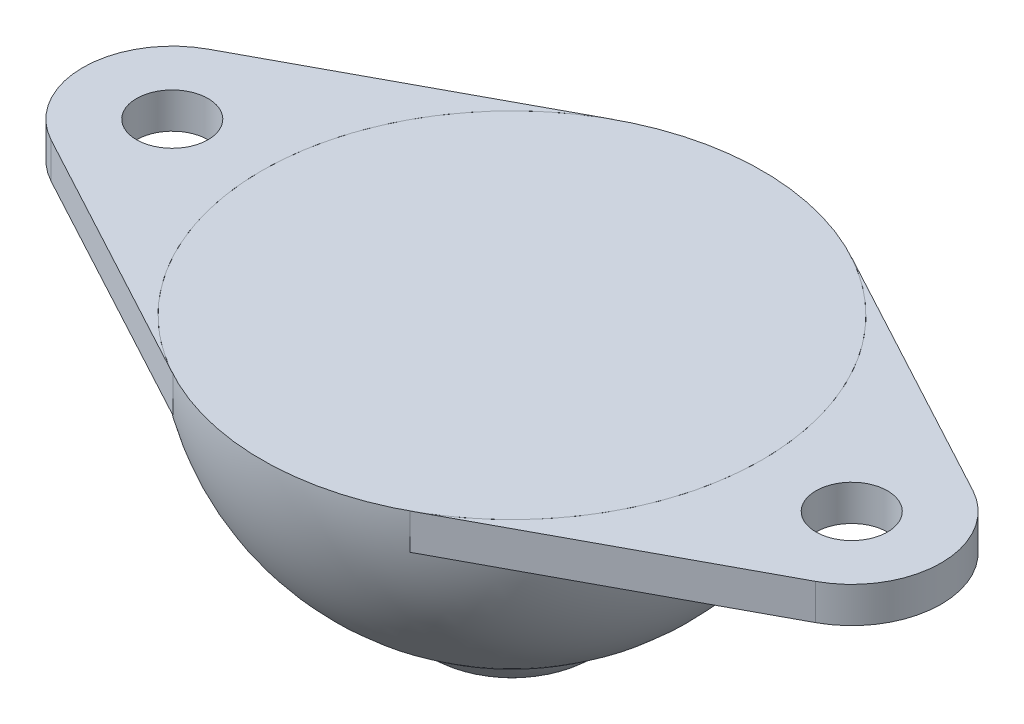
ISO-10303-21;
HEADER;
FILE_DESCRIPTION(('STEP AP214'),'2;1');
FILE_NAME('part.step','',(''),(''),'','','');
FILE_SCHEMA(('AUTOMOTIVE_DESIGN { 1 0 10303 214 1 1 1 1 }'));
ENDSEC;
DATA;
#1=APPLICATION_CONTEXT('core data for automotive mechanical design processes');
#2=APPLICATION_PROTOCOL_DEFINITION('international standard','automotive_design',2000,#1);
#3=PRODUCT_CONTEXT('',#1,'mechanical');
#4=PRODUCT('Part','Part','',(#3));
#5=PRODUCT_RELATED_PRODUCT_CATEGORY('part','',(#4));
#6=PRODUCT_DEFINITION_FORMATION('','',#4);
#7=PRODUCT_DEFINITION_CONTEXT('part definition',#1,'design');
#8=PRODUCT_DEFINITION('design','',#6,#7);
#9=PRODUCT_DEFINITION_SHAPE('','',#8);
#10=(LENGTH_UNIT() NAMED_UNIT(*) SI_UNIT(.MILLI.,.METRE.));
#11=(NAMED_UNIT(*) PLANE_ANGLE_UNIT() SI_UNIT($,.RADIAN.));
#12=(NAMED_UNIT(*) SI_UNIT($,.STERADIAN.) SOLID_ANGLE_UNIT());
#13=UNCERTAINTY_MEASURE_WITH_UNIT(LENGTH_MEASURE(1.E-05),#10,'distance_accuracy_value','');
#14=(GEOMETRIC_REPRESENTATION_CONTEXT(3) GLOBAL_UNCERTAINTY_ASSIGNED_CONTEXT((#13)) GLOBAL_UNIT_ASSIGNED_CONTEXT((#10,
#11,#12)) REPRESENTATION_CONTEXT('',''));
#15=CARTESIAN_POINT('',(0.,0.,0.));
#16=DIRECTION('',(0.,0.,1.));
#17=DIRECTION('',(1.,0.,0.));
#18=AXIS2_PLACEMENT_3D('',#15,#16,#17);
#19=CARTESIAN_POINT('',(0.,7.,0.));
#20=DIRECTION('',(0.,1.,0.));
#21=DIRECTION('',(-1.,0.,0.));
#22=AXIS2_PLACEMENT_3D('',#19,#20,#21);
#23=CYLINDRICAL_SURFACE('',#22,14.);
#24=CARTESIAN_POINT('',(0.,9.,0.));
#25=DIRECTION('',(0.,1.,0.));
#26=DIRECTION('',(-1.,0.,0.));
#27=AXIS2_PLACEMENT_3D('',#24,#25,#26);
#28=CIRCLE('',#27,14.);
#29=CARTESIAN_POINT('',(-6.63157894736842,9.,-12.329726706818));
#30=VERTEX_POINT('',#29);
#31=CARTESIAN_POINT('',(-6.63157894736842,9.,12.329726706818));
#32=VERTEX_POINT('',#31);
#33=EDGE_CURVE('E116',#30,#32,#28,.T.);
#34=ORIENTED_EDGE('',*,*,#33,.T.);
#35=DIRECTION('',(0.,1.,0.));
#36=VECTOR('',#35,1.);
#37=CARTESIAN_POINT('',(-6.63157894736842,7.,12.329726706818));
#38=LINE('',#37,#36);
#39=CARTESIAN_POINT('',(-6.63157894736842,7.,12.329726706818));
#40=VERTEX_POINT('',#39);
#41=EDGE_CURVE('E12',#40,#32,#38,.T.);
#42=ORIENTED_EDGE('',*,*,#41,.F.);
#43=CARTESIAN_POINT('',(0.,7.,0.));
#44=DIRECTION('',(0.,1.,0.));
#45=DIRECTION('',(-1.,0.,0.));
#46=AXIS2_PLACEMENT_3D('',#43,#44,#45);
#47=CIRCLE('',#46,14.);
#48=CARTESIAN_POINT('',(-6.63157894736842,7.,-12.329726706818));
#49=VERTEX_POINT('',#48);
#50=EDGE_CURVE('E68',#49,#40,#47,.T.);
#51=ORIENTED_EDGE('',*,*,#50,.F.);
#52=DIRECTION('',(0.,1.,0.));
#53=VECTOR('',#52,1.);
#54=CARTESIAN_POINT('',(-6.63157894736842,7.,-12.329726706818));
#55=LINE('',#54,#53);
#56=EDGE_CURVE('E53',#49,#30,#55,.T.);
#57=ORIENTED_EDGE('',*,*,#56,.T.);
#58=EDGE_LOOP('',(#34,#42,#51,#57));
#59=FACE_BOUND('',#58,.T.);
#60=ADVANCED_FACE('F50',(#59),#23,.F.);
#61=CARTESIAN_POINT('',(-6.63157894736842,7.,12.329726706818));
#62=DIRECTION('',(-0.473684210526316,0.,0.880694764772711));
#63=DIRECTION('',(0.880694764772711,0.,0.473684210526316));
#64=AXIS2_PLACEMENT_3D('',#61,#62,#63);
#65=PLANE('',#64);
#66=DIRECTION('',(0.880694764772711,0.,0.473684210526316));
#67=VECTOR('',#66,1.);
#68=CARTESIAN_POINT('',(-6.63157894736842,9.,12.329726706818));
#69=LINE('',#68,#67);
#70=CARTESIAN_POINT('',(-21.3684210526316,9.,4.40347382386355));
#71=VERTEX_POINT('',#70);
#72=EDGE_CURVE('E121',#71,#32,#69,.T.);
#73=ORIENTED_EDGE('',*,*,#72,.F.);
#74=DIRECTION('',(0.,1.,0.));
#75=VECTOR('',#74,1.);
#76=CARTESIAN_POINT('',(-21.3684210526316,7.,4.40347382386355));
#77=LINE('',#76,#75);
#78=CARTESIAN_POINT('',(-21.3684210526316,7.,4.40347382386355));
#79=VERTEX_POINT('',#78);
#80=EDGE_CURVE('E59',#79,#71,#77,.T.);
#81=ORIENTED_EDGE('',*,*,#80,.F.);
#82=DIRECTION('',(0.880694764772711,0.,0.473684210526316));
#83=VECTOR('',#82,1.);
#84=CARTESIAN_POINT('',(-6.63157894736842,7.,12.329726706818));
#85=LINE('',#84,#83);
#86=EDGE_CURVE('E108',#79,#40,#85,.T.);
#87=ORIENTED_EDGE('',*,*,#86,.T.);
#88=ORIENTED_EDGE('',*,*,#41,.T.);
#89=EDGE_LOOP('',(#73,#81,#87,#88));
#90=FACE_BOUND('',#89,.T.);
#91=ADVANCED_FACE('F142',(#90),#65,.T.);
#92=CARTESIAN_POINT('',(-19.,7.,0.));
#93=DIRECTION('',(0.,1.,0.));
#94=DIRECTION('',(-1.,0.,0.));
#95=AXIS2_PLACEMENT_3D('',#92,#93,#94);
#96=CYLINDRICAL_SURFACE('',#95,5.);
#97=CARTESIAN_POINT('',(-19.,9.,0.));
#98=DIRECTION('',(0.,1.,0.));
#99=DIRECTION('',(-1.,0.,0.));
#100=AXIS2_PLACEMENT_3D('',#97,#98,#99);
#101=CIRCLE('',#100,5.);
#102=CARTESIAN_POINT('',(-21.3684210526316,9.,-4.40347382386355));
#103=VERTEX_POINT('',#102);
#104=EDGE_CURVE('E100',#103,#71,#101,.T.);
#105=ORIENTED_EDGE('',*,*,#104,.F.);
#106=DIRECTION('',(0.,1.,0.));
#107=VECTOR('',#106,1.);
#108=CARTESIAN_POINT('',(-21.3684210526316,7.,-4.40347382386355));
#109=LINE('',#108,#107);
#110=CARTESIAN_POINT('',(-21.3684210526316,7.,-4.40347382386355));
#111=VERTEX_POINT('',#110);
#112=EDGE_CURVE('E97',#111,#103,#109,.T.);
#113=ORIENTED_EDGE('',*,*,#112,.F.);
#114=CARTESIAN_POINT('',(-19.,7.,0.));
#115=DIRECTION('',(0.,1.,0.));
#116=DIRECTION('',(-1.,0.,0.));
#117=AXIS2_PLACEMENT_3D('',#114,#115,#116);
#118=CIRCLE('',#117,5.);
#119=EDGE_CURVE('E99',#111,#79,#118,.T.);
#120=ORIENTED_EDGE('',*,*,#119,.T.);
#121=ORIENTED_EDGE('',*,*,#80,.T.);
#122=EDGE_LOOP('',(#105,#113,#120,#121));
#123=FACE_BOUND('',#122,.T.);
#124=ADVANCED_FACE('F98',(#123),#96,.T.);
#125=CARTESIAN_POINT('',(-6.63157894736842,7.,-12.329726706818));
#126=DIRECTION('',(0.473684210526316,0.,0.880694764772711));
#127=DIRECTION('',(0.880694764772711,0.,-0.473684210526316));
#128=AXIS2_PLACEMENT_3D('',#125,#126,#127);
#129=PLANE('',#128);
#130=DIRECTION('',(0.880694764772711,0.,-0.473684210526316));
#131=VECTOR('',#130,1.);
#132=CARTESIAN_POINT('',(-6.63157894736842,9.,-12.329726706818));
#133=LINE('',#132,#131);
#134=EDGE_CURVE('E118',#103,#30,#133,.T.);
#135=ORIENTED_EDGE('',*,*,#134,.T.);
#136=ORIENTED_EDGE('',*,*,#56,.F.);
#137=DIRECTION('',(0.880694764772711,0.,-0.473684210526316));
#138=VECTOR('',#137,1.);
#139=CARTESIAN_POINT('',(-6.63157894736842,7.,-12.329726706818));
#140=LINE('',#139,#138);
#141=EDGE_CURVE('E94',#111,#49,#140,.T.);
#142=ORIENTED_EDGE('',*,*,#141,.F.);
#143=ORIENTED_EDGE('',*,*,#112,.T.);
#144=EDGE_LOOP('',(#135,#136,#142,#143));
#145=FACE_BOUND('',#144,.T.);
#146=ADVANCED_FACE('F103',(#145),#129,.F.);
#147=CARTESIAN_POINT('',(-19.,7.,0.));
#148=DIRECTION('',(0.,1.,0.));
#149=DIRECTION('',(-1.,0.,0.));
#150=AXIS2_PLACEMENT_3D('',#147,#148,#149);
#151=CYLINDRICAL_SURFACE('',#150,2.);
#152=CARTESIAN_POINT('',(-19.,7.,0.));
#153=DIRECTION('',(0.,1.,0.));
#154=DIRECTION('',(-1.,0.,0.));
#155=AXIS2_PLACEMENT_3D('',#152,#153,#154);
#156=CIRCLE('',#155,2.);
#157=CARTESIAN_POINT('',(-21.,7.,0.));
#158=VERTEX_POINT('',#157);
#159=EDGE_CURVE('E110',#158,#158,#156,.T.);
#160=ORIENTED_EDGE('',*,*,#159,.F.);
#161=EDGE_LOOP('',(#160));
#162=FACE_BOUND('',#161,.T.);
#163=CARTESIAN_POINT('',(-19.,9.,0.));
#164=DIRECTION('',(0.,1.,0.));
#165=DIRECTION('',(-1.,0.,0.));
#166=AXIS2_PLACEMENT_3D('',#163,#164,#165);
#167=CIRCLE('',#166,2.);
#168=CARTESIAN_POINT('',(-21.,9.,0.));
#169=VERTEX_POINT('',#168);
#170=EDGE_CURVE('E124',#169,#169,#167,.T.);
#171=ORIENTED_EDGE('',*,*,#170,.T.);
#172=EDGE_LOOP('',(#171));
#173=FACE_BOUND('',#172,.T.);
#174=ADVANCED_FACE('F129',(#162,#173),#151,.F.);
#175=CARTESIAN_POINT('',(0.,7.,0.));
#176=DIRECTION('',(0.,1.,0.));
#177=DIRECTION('',(-1.,0.,0.));
#178=AXIS2_PLACEMENT_3D('',#175,#176,#177);
#179=PLANE('',#178);
#180=ORIENTED_EDGE('',*,*,#50,.T.);
#181=ORIENTED_EDGE('',*,*,#86,.F.);
#182=ORIENTED_EDGE('',*,*,#119,.F.);
#183=ORIENTED_EDGE('',*,*,#141,.T.);
#184=EDGE_LOOP('',(#180,#181,#182,#183));
#185=FACE_BOUND('',#184,.T.);
#186=ORIENTED_EDGE('',*,*,#159,.T.);
#187=EDGE_LOOP('',(#186));
#188=FACE_BOUND('',#187,.T.);
#189=ADVANCED_FACE('F106',(#185,#188),#179,.F.);
#190=CARTESIAN_POINT('',(0.,9.,0.));
#191=DIRECTION('',(0.,1.,0.));
#192=DIRECTION('',(-1.,0.,0.));
#193=AXIS2_PLACEMENT_3D('',#190,#191,#192);
#194=PLANE('',#193);
#195=ORIENTED_EDGE('',*,*,#33,.F.);
#196=ORIENTED_EDGE('',*,*,#134,.F.);
#197=ORIENTED_EDGE('',*,*,#104,.T.);
#198=ORIENTED_EDGE('',*,*,#72,.T.);
#199=EDGE_LOOP('',(#195,#196,#197,#198));
#200=FACE_BOUND('',#199,.T.);
#201=ORIENTED_EDGE('',*,*,#170,.F.);
#202=EDGE_LOOP('',(#201));
#203=FACE_BOUND('',#202,.T.);
#204=ADVANCED_FACE('F131',(#200,#203),#194,.T.);
#205=CLOSED_SHELL('',(#60,#91,#124,#146,#174,#189,#204));
#206=MANIFOLD_SOLID_BREP('B2',#205);
#207=CARTESIAN_POINT('',(0.,7.,0.));
#208=DIRECTION('',(0.,1.,0.));
#209=DIRECTION('',(-1.,0.,0.));
#210=AXIS2_PLACEMENT_3D('',#207,#208,#209);
#211=CYLINDRICAL_SURFACE('',#210,14.);
#212=CARTESIAN_POINT('',(0.,9.,0.));
#213=DIRECTION('',(0.,1.,0.));
#214=DIRECTION('',(-1.,0.,0.));
#215=AXIS2_PLACEMENT_3D('',#212,#213,#214);
#216=CIRCLE('',#215,14.);
#217=CARTESIAN_POINT('',(6.63157894736842,9.,12.329726706818));
#218=VERTEX_POINT('',#217);
#219=CARTESIAN_POINT('',(6.63157894736843,9.,-12.329726706818));
#220=VERTEX_POINT('',#219);
#221=EDGE_CURVE('E284',#218,#220,#216,.T.);
#222=ORIENTED_EDGE('',*,*,#221,.T.);
#223=DIRECTION('',(0.,1.,0.));
#224=VECTOR('',#223,1.);
#225=CARTESIAN_POINT('',(6.63157894736843,7.,-12.329726706818));
#226=LINE('',#225,#224);
#227=CARTESIAN_POINT('',(6.63157894736843,7.,-12.329726706818));
#228=VERTEX_POINT('',#227);
#229=EDGE_CURVE('E48',#228,#220,#226,.T.);
#230=ORIENTED_EDGE('',*,*,#229,.F.);
#231=CARTESIAN_POINT('',(0.,7.,0.));
#232=DIRECTION('',(0.,1.,0.));
#233=DIRECTION('',(-1.,0.,0.));
#234=AXIS2_PLACEMENT_3D('',#231,#232,#233);
#235=CIRCLE('',#234,14.);
#236=CARTESIAN_POINT('',(6.63157894736842,7.,12.329726706818));
#237=VERTEX_POINT('',#236);
#238=EDGE_CURVE('E235',#237,#228,#235,.T.);
#239=ORIENTED_EDGE('',*,*,#238,.F.);
#240=DIRECTION('',(0.,1.,0.));
#241=VECTOR('',#240,1.);
#242=CARTESIAN_POINT('',(6.63157894736842,7.,12.329726706818));
#243=LINE('',#242,#241);
#244=EDGE_CURVE('E220',#237,#218,#243,.T.);
#245=ORIENTED_EDGE('',*,*,#244,.T.);
#246=EDGE_LOOP('',(#222,#230,#239,#245));
#247=FACE_BOUND('',#246,.T.);
#248=ADVANCED_FACE('F217',(#247),#211,.F.);
#249=CARTESIAN_POINT('',(6.63157894736843,7.,-12.329726706818));
#250=DIRECTION('',(0.473684210526316,0.,-0.880694764772711));
#251=DIRECTION('',(-0.880694764772711,0.,-0.473684210526316));
#252=AXIS2_PLACEMENT_3D('',#249,#250,#251);
#253=PLANE('',#252);
#254=DIRECTION('',(-0.880694764772711,0.,-0.473684210526316));
#255=VECTOR('',#254,1.);
#256=CARTESIAN_POINT('',(6.63157894736843,9.,-12.329726706818));
#257=LINE('',#256,#255);
#258=CARTESIAN_POINT('',(21.3684210526316,9.,-4.40347382386356));
#259=VERTEX_POINT('',#258);
#260=EDGE_CURVE('E289',#259,#220,#257,.T.);
#261=ORIENTED_EDGE('',*,*,#260,.F.);
#262=DIRECTION('',(0.,1.,0.));
#263=VECTOR('',#262,1.);
#264=CARTESIAN_POINT('',(21.3684210526316,7.,-4.40347382386356));
#265=LINE('',#264,#263);
#266=CARTESIAN_POINT('',(21.3684210526316,7.,-4.40347382386356));
#267=VERTEX_POINT('',#266);
#268=EDGE_CURVE('E226',#267,#259,#265,.T.);
#269=ORIENTED_EDGE('',*,*,#268,.F.);
#270=DIRECTION('',(-0.880694764772711,0.,-0.473684210526316));
#271=VECTOR('',#270,1.);
#272=CARTESIAN_POINT('',(6.63157894736843,7.,-12.329726706818));
#273=LINE('',#272,#271);
#274=EDGE_CURVE('E266',#267,#228,#273,.T.);
#275=ORIENTED_EDGE('',*,*,#274,.T.);
#276=ORIENTED_EDGE('',*,*,#229,.T.);
#277=EDGE_LOOP('',(#261,#269,#275,#276));
#278=FACE_BOUND('',#277,.T.);
#279=ADVANCED_FACE('F310',(#278),#253,.T.);
#280=CARTESIAN_POINT('',(19.,7.,0.));
#281=DIRECTION('',(0.,1.,0.));
#282=DIRECTION('',(-1.,0.,0.));
#283=AXIS2_PLACEMENT_3D('',#280,#281,#282);
#284=CYLINDRICAL_SURFACE('',#283,5.);
#285=CARTESIAN_POINT('',(19.,9.,0.));
#286=DIRECTION('',(0.,1.,0.));
#287=DIRECTION('',(-1.,0.,0.));
#288=AXIS2_PLACEMENT_3D('',#285,#286,#287);
#289=CIRCLE('',#288,5.);
#290=CARTESIAN_POINT('',(21.3684210526316,9.,4.40347382386355));
#291=VERTEX_POINT('',#290);
#292=EDGE_CURVE('E271',#259,#291,#289,.F.);
#293=ORIENTED_EDGE('',*,*,#292,.T.);
#294=DIRECTION('',(0.,1.,0.));
#295=VECTOR('',#294,1.);
#296=CARTESIAN_POINT('',(21.3684210526316,7.,4.40347382386355));
#297=LINE('',#296,#295);
#298=CARTESIAN_POINT('',(21.3684210526316,7.,4.40347382386355));
#299=VERTEX_POINT('',#298);
#300=EDGE_CURVE('E269',#299,#291,#297,.T.);
#301=ORIENTED_EDGE('',*,*,#300,.F.);
#302=CARTESIAN_POINT('',(19.,7.,0.));
#303=DIRECTION('',(0.,1.,0.));
#304=DIRECTION('',(-1.,0.,0.));
#305=AXIS2_PLACEMENT_3D('',#302,#303,#304);
#306=CIRCLE('',#305,5.);
#307=EDGE_CURVE('E262',#267,#299,#306,.F.);
#308=ORIENTED_EDGE('',*,*,#307,.F.);
#309=ORIENTED_EDGE('',*,*,#268,.T.);
#310=EDGE_LOOP('',(#293,#301,#308,#309));
#311=FACE_BOUND('',#310,.T.);
#312=ADVANCED_FACE('F270',(#311),#284,.T.);
#313=CARTESIAN_POINT('',(6.63157894736842,7.,12.329726706818));
#314=DIRECTION('',(-0.473684210526316,0.,-0.880694764772711));
#315=DIRECTION('',(-0.880694764772711,0.,0.473684210526316));
#316=AXIS2_PLACEMENT_3D('',#313,#314,#315);
#317=PLANE('',#316);
#318=DIRECTION('',(-0.880694764772711,0.,0.473684210526316));
#319=VECTOR('',#318,1.);
#320=CARTESIAN_POINT('',(6.63157894736842,9.,12.329726706818));
#321=LINE('',#320,#319);
#322=EDGE_CURVE('E286',#291,#218,#321,.T.);
#323=ORIENTED_EDGE('',*,*,#322,.T.);
#324=ORIENTED_EDGE('',*,*,#244,.F.);
#325=DIRECTION('',(-0.880694764772711,0.,0.473684210526316));
#326=VECTOR('',#325,1.);
#327=CARTESIAN_POINT('',(6.63157894736842,7.,12.329726706818));
#328=LINE('',#327,#326);
#329=EDGE_CURVE('E260',#299,#237,#328,.T.);
#330=ORIENTED_EDGE('',*,*,#329,.F.);
#331=ORIENTED_EDGE('',*,*,#300,.T.);
#332=EDGE_LOOP('',(#323,#324,#330,#331));
#333=FACE_BOUND('',#332,.T.);
#334=ADVANCED_FACE('F274',(#333),#317,.F.);
#335=CARTESIAN_POINT('',(19.,7.,0.));
#336=DIRECTION('',(0.,1.,0.));
#337=DIRECTION('',(-1.,0.,0.));
#338=AXIS2_PLACEMENT_3D('',#335,#336,#337);
#339=CYLINDRICAL_SURFACE('',#338,2.);
#340=CARTESIAN_POINT('',(19.,7.,0.));
#341=DIRECTION('',(0.,1.,0.));
#342=DIRECTION('',(-1.,0.,0.));
#343=AXIS2_PLACEMENT_3D('',#340,#341,#342);
#344=CIRCLE('',#343,2.);
#345=CARTESIAN_POINT('',(17.,7.,0.));
#346=VERTEX_POINT('',#345);
#347=EDGE_CURVE('E281',#346,#346,#344,.F.);
#348=ORIENTED_EDGE('',*,*,#347,.T.);
#349=EDGE_LOOP('',(#348));
#350=FACE_BOUND('',#349,.T.);
#351=CARTESIAN_POINT('',(19.,9.,0.));
#352=DIRECTION('',(0.,1.,0.));
#353=DIRECTION('',(-1.,0.,0.));
#354=AXIS2_PLACEMENT_3D('',#351,#352,#353);
#355=CIRCLE('',#354,2.);
#356=CARTESIAN_POINT('',(17.,9.,0.));
#357=VERTEX_POINT('',#356);
#358=EDGE_CURVE('E277',#357,#357,#355,.F.);
#359=ORIENTED_EDGE('',*,*,#358,.F.);
#360=EDGE_LOOP('',(#359));
#361=FACE_BOUND('',#360,.T.);
#362=ADVANCED_FACE('F298',(#350,#361),#339,.F.);
#363=CARTESIAN_POINT('',(0.,7.,0.));
#364=DIRECTION('',(0.,1.,0.));
#365=DIRECTION('',(-1.,0.,0.));
#366=AXIS2_PLACEMENT_3D('',#363,#364,#365);
#367=PLANE('',#366);
#368=ORIENTED_EDGE('',*,*,#238,.T.);
#369=ORIENTED_EDGE('',*,*,#274,.F.);
#370=ORIENTED_EDGE('',*,*,#307,.T.);
#371=ORIENTED_EDGE('',*,*,#329,.T.);
#372=EDGE_LOOP('',(#368,#369,#370,#371));
#373=FACE_BOUND('',#372,.T.);
#374=ORIENTED_EDGE('',*,*,#347,.F.);
#375=EDGE_LOOP('',(#374));
#376=FACE_BOUND('',#375,.T.);
#377=ADVANCED_FACE('F264',(#373,#376),#367,.F.);
#378=CARTESIAN_POINT('',(0.,9.,0.));
#379=DIRECTION('',(0.,1.,0.));
#380=DIRECTION('',(-1.,0.,0.));
#381=AXIS2_PLACEMENT_3D('',#378,#379,#380);
#382=PLANE('',#381);
#383=ORIENTED_EDGE('',*,*,#221,.F.);
#384=ORIENTED_EDGE('',*,*,#322,.F.);
#385=ORIENTED_EDGE('',*,*,#292,.F.);
#386=ORIENTED_EDGE('',*,*,#260,.T.);
#387=EDGE_LOOP('',(#383,#384,#385,#386));
#388=FACE_BOUND('',#387,.T.);
#389=ORIENTED_EDGE('',*,*,#358,.T.);
#390=EDGE_LOOP('',(#389));
#391=FACE_BOUND('',#390,.T.);
#392=ADVANCED_FACE('F296',(#388,#391),#382,.T.);
#393=CLOSED_SHELL('',(#248,#279,#312,#334,#362,#377,#392));
#394=MANIFOLD_SOLID_BREP('B6',#393);
#395=CARTESIAN_POINT('',(0.,0.,0.));
#396=DIRECTION('',(0.,1.,0.));
#397=DIRECTION('',(1.,0.,0.));
#398=AXIS2_PLACEMENT_3D('',#395,#396,#397);
#399=SPHERICAL_SURFACE('',#398,7.);
#400=CARTESIAN_POINT('',(0.,0.,0.));
#401=DIRECTION('',(0.,1.,0.));
#402=DIRECTION('',(-1.,0.,0.));
#403=AXIS2_PLACEMENT_3D('',#400,#401,#402);
#404=CIRCLE('',#403,7.);
#405=CARTESIAN_POINT('',(-7.,0.,0.));
#406=VERTEX_POINT('',#405);
#407=EDGE_CURVE('E216',#406,#406,#404,.T.);
#408=ORIENTED_EDGE('',*,*,#407,.F.);
#409=EDGE_LOOP('',(#408));
#410=FACE_BOUND('',#409,.T.);
#411=ADVANCED_FACE('F377',(#410),#399,.T.);
#412=CARTESIAN_POINT('',(7.,0.,0.));
#413=DIRECTION('',(0.,1.,0.));
#414=DIRECTION('',(-1.,0.,0.));
#415=AXIS2_PLACEMENT_3D('',#412,#413,#414);
#416=PLANE('',#415);
#417=CARTESIAN_POINT('',(0.,0.,0.));
#418=DIRECTION('',(0.,1.,0.));
#419=DIRECTION('',(-1.,0.,0.));
#420=AXIS2_PLACEMENT_3D('',#417,#418,#419);
#421=CIRCLE('',#420,7.01802812514553);
#422=CARTESIAN_POINT('',(-7.01802812514553,0.,0.));
#423=VERTEX_POINT('',#422);
#424=EDGE_CURVE('E383',#423,#423,#421,.T.);
#425=ORIENTED_EDGE('',*,*,#424,.F.);
#426=EDGE_LOOP('',(#425));
#427=FACE_BOUND('',#426,.T.);
#428=ORIENTED_EDGE('',*,*,#407,.T.);
#429=EDGE_LOOP('',(#428));
#430=FACE_BOUND('',#429,.T.);
#431=ADVANCED_FACE('F407',(#427,#430),#416,.F.);
#432=CARTESIAN_POINT('',(0.,9.,0.));
#433=DIRECTION('',(0.,1.,0.));
#434=DIRECTION('',(-1.,0.,0.));
#435=AXIS2_PLACEMENT_3D('',#432,#433,#434);
#436=CYLINDRICAL_SURFACE('',#435,7.01802812514553);
#437=CARTESIAN_POINT('',(0.,-3.1139292236114,0.));
#438=DIRECTION('',(0.,1.,0.));
#439=DIRECTION('',(-1.,0.,0.));
#440=AXIS2_PLACEMENT_3D('',#437,#438,#439);
#441=CIRCLE('',#440,7.01802812514553);
#442=CARTESIAN_POINT('',(-7.01802812514553,-3.1139292236114,0.));
#443=VERTEX_POINT('',#442);
#444=EDGE_CURVE('E387',#443,#443,#441,.T.);
#445=ORIENTED_EDGE('',*,*,#444,.F.);
#446=EDGE_LOOP('',(#445));
#447=FACE_BOUND('',#446,.T.);
#448=ORIENTED_EDGE('',*,*,#424,.T.);
#449=EDGE_LOOP('',(#448));
#450=FACE_BOUND('',#449,.T.);
#451=ADVANCED_FACE('F402',(#447,#450),#436,.F.);
#452=CARTESIAN_POINT('',(0.,9.,0.));
#453=DIRECTION('',(0.,1.,0.));
#454=DIRECTION('',(1.,0.,0.));
#455=AXIS2_PLACEMENT_3D('',#452,#453,#454);
#456=SPHERICAL_SURFACE('',#455,14.);
#457=CARTESIAN_POINT('',(0.,9.,0.));
#458=DIRECTION('',(0.,1.,0.));
#459=DIRECTION('',(-1.,0.,0.));
#460=AXIS2_PLACEMENT_3D('',#457,#458,#459);
#461=CIRCLE('',#460,14.);
#462=CARTESIAN_POINT('',(-14.,9.00000000000001,0.));
#463=VERTEX_POINT('',#462);
#464=EDGE_CURVE('E391',#463,#463,#461,.T.);
#465=ORIENTED_EDGE('',*,*,#464,.F.);
#466=EDGE_LOOP('',(#465));
#467=FACE_BOUND('',#466,.T.);
#468=ORIENTED_EDGE('',*,*,#444,.T.);
#469=EDGE_LOOP('',(#468));
#470=FACE_BOUND('',#469,.T.);
#471=ADVANCED_FACE('F399',(#467,#470),#456,.T.);
#472=CARTESIAN_POINT('',(0.,9.,0.));
#473=DIRECTION('',(0.,-1.,0.));
#474=DIRECTION('',(1.,0.,0.));
#475=AXIS2_PLACEMENT_3D('',#472,#473,#474);
#476=PLANE('',#475);
#477=ORIENTED_EDGE('',*,*,#464,.T.);
#478=EDGE_LOOP('',(#477));
#479=FACE_BOUND('',#478,.T.);
#480=ADVANCED_FACE('F397',(#479),#476,.F.);
#481=CLOSED_SHELL('',(#411,#431,#451,#471,#480));
#482=MANIFOLD_SOLID_BREP('B42',#481);
#483=ADVANCED_BREP_SHAPE_REPRESENTATION('',(#18,#206,#394,#482),#14);
#484=SHAPE_DEFINITION_REPRESENTATION(#9,#483);
ENDSEC;
END-ISO-10303-21;
